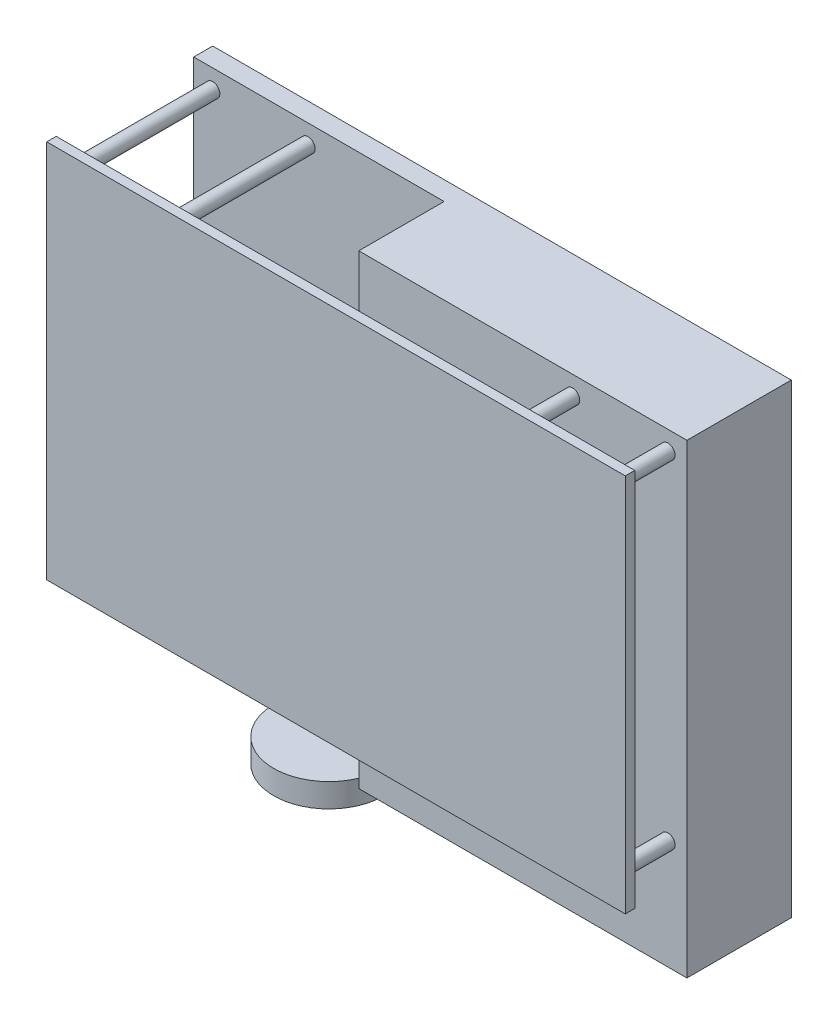
ISO-10303-21;
HEADER;
FILE_DESCRIPTION(('STEP AP214'),'2;1');
FILE_NAME('part.step','',(''),(''),'','','');
FILE_SCHEMA(('AUTOMOTIVE_DESIGN { 1 0 10303 214 1 1 1 1 }'));
ENDSEC;
DATA;
#1=APPLICATION_CONTEXT('core data for automotive mechanical design processes');
#2=APPLICATION_PROTOCOL_DEFINITION('international standard','automotive_design',2000,#1);
#3=PRODUCT_CONTEXT('',#1,'mechanical');
#4=PRODUCT('Part','Part','',(#3));
#5=PRODUCT_RELATED_PRODUCT_CATEGORY('part','',(#4));
#6=PRODUCT_DEFINITION_FORMATION('','',#4);
#7=PRODUCT_DEFINITION_CONTEXT('part definition',#1,'design');
#8=PRODUCT_DEFINITION('design','',#6,#7);
#9=PRODUCT_DEFINITION_SHAPE('','',#8);
#10=(LENGTH_UNIT() NAMED_UNIT(*) SI_UNIT(.MILLI.,.METRE.));
#11=(NAMED_UNIT(*) PLANE_ANGLE_UNIT() SI_UNIT($,.RADIAN.));
#12=(NAMED_UNIT(*) SI_UNIT($,.STERADIAN.) SOLID_ANGLE_UNIT());
#13=UNCERTAINTY_MEASURE_WITH_UNIT(LENGTH_MEASURE(1.E-05),#10,'distance_accuracy_value','');
#14=(GEOMETRIC_REPRESENTATION_CONTEXT(3) GLOBAL_UNCERTAINTY_ASSIGNED_CONTEXT((#13)) GLOBAL_UNIT_ASSIGNED_CONTEXT((#10,
#11,#12)) REPRESENTATION_CONTEXT('',''));
#15=CARTESIAN_POINT('',(0.,0.,0.));
#16=DIRECTION('',(0.,0.,1.));
#17=DIRECTION('',(1.,0.,0.));
#18=AXIS2_PLACEMENT_3D('',#15,#16,#17);
#19=CARTESIAN_POINT('',(-20.85,-63.2,-17.35));
#20=DIRECTION('',(0.,1.,0.));
#21=DIRECTION('',(0.,0.,1.));
#22=AXIS2_PLACEMENT_3D('',#19,#20,#21);
#23=CYLINDRICAL_SURFACE('',#22,11.65);
#24=CARTESIAN_POINT('',(-20.85,-63.2,-17.35));
#25=DIRECTION('',(0.,-1.,0.));
#26=DIRECTION('',(0.,0.,-1.));
#27=AXIS2_PLACEMENT_3D('',#24,#25,#26);
#28=CIRCLE('',#27,11.65);
#29=CARTESIAN_POINT('',(-20.85,-63.2,-29.));
#30=VERTEX_POINT('',#29);
#31=EDGE_CURVE('E11',#30,#30,#28,.T.);
#32=ORIENTED_EDGE('',*,*,#31,.F.);
#33=EDGE_LOOP('',(#32));
#34=FACE_BOUND('',#33,.T.);
#35=CARTESIAN_POINT('',(-20.85,-58.2,-17.35));
#36=DIRECTION('',(0.,-1.,0.));
#37=DIRECTION('',(0.,0.,-1.));
#38=AXIS2_PLACEMENT_3D('',#35,#36,#37);
#39=CIRCLE('',#38,11.65);
#40=CARTESIAN_POINT('',(-20.85,-58.2,-29.));
#41=VERTEX_POINT('',#40);
#42=EDGE_CURVE('E46',#41,#41,#39,.T.);
#43=ORIENTED_EDGE('',*,*,#42,.T.);
#44=EDGE_LOOP('',(#43));
#45=FACE_BOUND('',#44,.T.);
#46=ADVANCED_FACE('F43',(#34,#45),#23,.T.);
#47=CARTESIAN_POINT('',(-20.85,-63.2,-17.35));
#48=DIRECTION('',(0.,-1.,0.));
#49=DIRECTION('',(0.,0.,-1.));
#50=AXIS2_PLACEMENT_3D('',#47,#48,#49);
#51=PLANE('',#50);
#52=ORIENTED_EDGE('',*,*,#31,.T.);
#53=EDGE_LOOP('',(#52));
#54=FACE_BOUND('',#53,.T.);
#55=ADVANCED_FACE('F58',(#54),#51,.T.);
#56=CARTESIAN_POINT('',(-20.85,-58.2,-17.35));
#57=DIRECTION('',(0.,-1.,0.));
#58=DIRECTION('',(0.,0.,-1.));
#59=AXIS2_PLACEMENT_3D('',#56,#57,#58);
#60=PLANE('',#59);
#61=ORIENTED_EDGE('',*,*,#42,.F.);
#62=EDGE_LOOP('',(#61));
#63=FACE_BOUND('',#62,.T.);
#64=ADVANCED_FACE('F56',(#63),#60,.F.);
#65=CLOSED_SHELL('',(#46,#55,#64));
#66=MANIFOLD_SOLID_BREP('B2',#65);
#67=CARTESIAN_POINT('',(57.,-35.2,-29.));
#68=DIRECTION('',(0.,0.,1.));
#69=DIRECTION('',(1.,0.,0.));
#70=AXIS2_PLACEMENT_3D('',#67,#68,#69);
#71=CYLINDRICAL_SURFACE('',#70,1.5);
#72=CARTESIAN_POINT('',(57.,-35.2,0.));
#73=DIRECTION('',(0.,0.,1.));
#74=DIRECTION('',(1.,0.,0.));
#75=AXIS2_PLACEMENT_3D('',#72,#73,#74);
#76=CIRCLE('',#75,1.5);
#77=CARTESIAN_POINT('',(58.5,-35.2,0.));
#78=VERTEX_POINT('',#77);
#79=EDGE_CURVE('E263',#78,#78,#76,.T.);
#80=ORIENTED_EDGE('',*,*,#79,.F.);
#81=EDGE_LOOP('',(#80));
#82=FACE_BOUND('',#81,.T.);
#83=CARTESIAN_POINT('',(57.,-35.2,-11.));
#84=DIRECTION('',(0.,0.,-1.));
#85=DIRECTION('',(-1.,0.,0.));
#86=AXIS2_PLACEMENT_3D('',#83,#84,#85);
#87=CIRCLE('',#86,1.5);
#88=CARTESIAN_POINT('',(55.5,-35.2,-11.));
#89=VERTEX_POINT('',#88);
#90=EDGE_CURVE('E205',#89,#89,#87,.F.);
#91=ORIENTED_EDGE('',*,*,#90,.T.);
#92=EDGE_LOOP('',(#91));
#93=FACE_BOUND('',#92,.T.);
#94=ADVANCED_FACE('F84',(#82,#93),#71,.T.);
#95=CARTESIAN_POINT('',(57.,36.,-29.));
#96=DIRECTION('',(0.,0.,1.));
#97=DIRECTION('',(1.,0.,0.));
#98=AXIS2_PLACEMENT_3D('',#95,#96,#97);
#99=CYLINDRICAL_SURFACE('',#98,1.5);
#100=CARTESIAN_POINT('',(57.,36.,0.));
#101=DIRECTION('',(0.,0.,1.));
#102=DIRECTION('',(1.,0.,0.));
#103=AXIS2_PLACEMENT_3D('',#100,#101,#102);
#104=CIRCLE('',#103,1.5);
#105=CARTESIAN_POINT('',(58.5,36.,0.));
#106=VERTEX_POINT('',#105);
#107=EDGE_CURVE('E284',#106,#106,#104,.T.);
#108=ORIENTED_EDGE('',*,*,#107,.F.);
#109=EDGE_LOOP('',(#108));
#110=FACE_BOUND('',#109,.T.);
#111=CARTESIAN_POINT('',(57.,36.,-11.));
#112=DIRECTION('',(0.,0.,-1.));
#113=DIRECTION('',(-1.,0.,0.));
#114=AXIS2_PLACEMENT_3D('',#111,#112,#113);
#115=CIRCLE('',#114,1.5);
#116=CARTESIAN_POINT('',(55.5,36.,-11.));
#117=VERTEX_POINT('',#116);
#118=EDGE_CURVE('E201',#117,#117,#115,.F.);
#119=ORIENTED_EDGE('',*,*,#118,.T.);
#120=EDGE_LOOP('',(#119));
#121=FACE_BOUND('',#120,.T.);
#122=ADVANCED_FACE('F299',(#110,#121),#99,.T.);
#123=CARTESIAN_POINT('',(0.,0.,-29.));
#124=DIRECTION('',(0.,0.,-1.));
#125=DIRECTION('',(-1.,0.,0.));
#126=AXIS2_PLACEMENT_3D('',#123,#124,#125);
#127=PLANE('',#126);
#128=CARTESIAN_POINT('',(-36.9,36.,-29.));
#129=DIRECTION('',(0.,0.,-1.));
#130=DIRECTION('',(-1.,0.,0.));
#131=AXIS2_PLACEMENT_3D('',#128,#129,#130);
#132=CIRCLE('',#131,1.5);
#133=CARTESIAN_POINT('',(-38.4,36.,-29.));
#134=VERTEX_POINT('',#133);
#135=EDGE_CURVE('E241',#134,#134,#132,.F.);
#136=ORIENTED_EDGE('',*,*,#135,.F.);
#137=EDGE_LOOP('',(#136));
#138=FACE_BOUND('',#137,.T.);
#139=CARTESIAN_POINT('',(-11.5,-35.2,-29.));
#140=DIRECTION('',(0.,0.,-1.));
#141=DIRECTION('',(-1.,0.,0.));
#142=AXIS2_PLACEMENT_3D('',#139,#140,#141);
#143=CIRCLE('',#142,1.5);
#144=CARTESIAN_POINT('',(-13.,-35.2,-29.));
#145=VERTEX_POINT('',#144);
#146=EDGE_CURVE('E244',#145,#145,#143,.F.);
#147=ORIENTED_EDGE('',*,*,#146,.F.);
#148=EDGE_LOOP('',(#147));
#149=FACE_BOUND('',#148,.T.);
#150=CARTESIAN_POINT('',(-57.,-35.2,-29.));
#151=DIRECTION('',(0.,0.,-1.));
#152=DIRECTION('',(-1.,0.,0.));
#153=AXIS2_PLACEMENT_3D('',#150,#151,#152);
#154=CIRCLE('',#153,1.5);
#155=CARTESIAN_POINT('',(-58.5,-35.2,-29.));
#156=VERTEX_POINT('',#155);
#157=EDGE_CURVE('E221',#156,#156,#154,.F.);
#158=ORIENTED_EDGE('',*,*,#157,.F.);
#159=EDGE_LOOP('',(#158));
#160=FACE_BOUND('',#159,.T.);
#161=CARTESIAN_POINT('',(-57.,36.,-29.));
#162=DIRECTION('',(0.,0.,-1.));
#163=DIRECTION('',(-1.,0.,0.));
#164=AXIS2_PLACEMENT_3D('',#161,#162,#163);
#165=CIRCLE('',#164,1.5);
#166=CARTESIAN_POINT('',(-58.5,36.,-29.));
#167=VERTEX_POINT('',#166);
#168=EDGE_CURVE('E214',#167,#167,#165,.F.);
#169=ORIENTED_EDGE('',*,*,#168,.F.);
#170=EDGE_LOOP('',(#169));
#171=FACE_BOUND('',#170,.T.);
#172=DIRECTION('',(0.,-1.,0.));
#173=VECTOR('',#172,1.);
#174=CARTESIAN_POINT('',(-8.20000000000002,40.,-29.));
#175=LINE('',#174,#173);
#176=CARTESIAN_POINT('',(-8.20000000000002,40.,-29.));
#177=VERTEX_POINT('',#176);
#178=CARTESIAN_POINT('',(-8.19999999999998,-58.2,-29.));
#179=VERTEX_POINT('',#178);
#180=EDGE_CURVE('E194',#177,#179,#175,.T.);
#181=ORIENTED_EDGE('',*,*,#180,.F.);
#182=DIRECTION('',(1.,0.,0.));
#183=VECTOR('',#182,1.);
#184=CARTESIAN_POINT('',(61.,40.,-29.));
#185=LINE('',#184,#183);
#186=CARTESIAN_POINT('',(-61.,40.,-29.));
#187=VERTEX_POINT('',#186);
#188=EDGE_CURVE('E224',#187,#177,#185,.T.);
#189=ORIENTED_EDGE('',*,*,#188,.F.);
#190=DIRECTION('',(0.,1.,0.));
#191=VECTOR('',#190,1.);
#192=CARTESIAN_POINT('',(-61.,40.,-29.));
#193=LINE('',#192,#191);
#194=CARTESIAN_POINT('',(-61.,-58.2,-29.));
#195=VERTEX_POINT('',#194);
#196=EDGE_CURVE('E231',#195,#187,#193,.T.);
#197=ORIENTED_EDGE('',*,*,#196,.F.);
#198=DIRECTION('',(-1.,0.,0.));
#199=VECTOR('',#198,1.);
#200=CARTESIAN_POINT('',(61.,-58.2,-29.));
#201=LINE('',#200,#199);
#202=CARTESIAN_POINT('',(-20.85,-58.2,-29.));
#203=VERTEX_POINT('',#202);
#204=EDGE_CURVE('E100',#203,#195,#201,.T.);
#205=ORIENTED_EDGE('',*,*,#204,.F.);
#206=EDGE_CURVE('E229',#179,#203,#201,.T.);
#207=ORIENTED_EDGE('',*,*,#206,.F.);
#208=EDGE_LOOP('',(#181,#189,#197,#205,#207));
#209=FACE_BOUND('',#208,.T.);
#210=ADVANCED_FACE('F296',(#138,#149,#160,#171,#209),#127,.F.);
#211=CARTESIAN_POINT('',(11.5,-35.2,-29.));
#212=DIRECTION('',(0.,0.,1.));
#213=DIRECTION('',(1.,0.,0.));
#214=AXIS2_PLACEMENT_3D('',#211,#212,#213);
#215=CYLINDRICAL_SURFACE('',#214,1.5);
#216=CARTESIAN_POINT('',(11.5,-35.2,0.));
#217=DIRECTION('',(0.,0.,1.));
#218=DIRECTION('',(1.,0.,0.));
#219=AXIS2_PLACEMENT_3D('',#216,#217,#218);
#220=CIRCLE('',#219,1.5);
#221=CARTESIAN_POINT('',(13.,-35.2,0.));
#222=VERTEX_POINT('',#221);
#223=EDGE_CURVE('E215',#222,#222,#220,.F.);
#224=ORIENTED_EDGE('',*,*,#223,.T.);
#225=EDGE_LOOP('',(#224));
#226=FACE_BOUND('',#225,.T.);
#227=CARTESIAN_POINT('',(11.5,-35.2,-11.));
#228=DIRECTION('',(0.,0.,-1.));
#229=DIRECTION('',(-1.,0.,0.));
#230=AXIS2_PLACEMENT_3D('',#227,#228,#229);
#231=CIRCLE('',#230,1.5);
#232=CARTESIAN_POINT('',(10.,-35.2,-11.));
#233=VERTEX_POINT('',#232);
#234=EDGE_CURVE('E41',#233,#233,#231,.T.);
#235=ORIENTED_EDGE('',*,*,#234,.F.);
#236=EDGE_LOOP('',(#235));
#237=FACE_BOUND('',#236,.T.);
#238=ADVANCED_FACE('F298',(#226,#237),#215,.T.);
#239=CARTESIAN_POINT('',(36.9,36.,-29.));
#240=DIRECTION('',(0.,0.,1.));
#241=DIRECTION('',(1.,0.,0.));
#242=AXIS2_PLACEMENT_3D('',#239,#240,#241);
#243=CYLINDRICAL_SURFACE('',#242,1.5);
#244=CARTESIAN_POINT('',(36.9,36.,0.));
#245=DIRECTION('',(0.,0.,1.));
#246=DIRECTION('',(1.,0.,0.));
#247=AXIS2_PLACEMENT_3D('',#244,#245,#246);
#248=CIRCLE('',#247,1.5);
#249=CARTESIAN_POINT('',(38.4,36.,0.));
#250=VERTEX_POINT('',#249);
#251=EDGE_CURVE('E208',#250,#250,#248,.F.);
#252=ORIENTED_EDGE('',*,*,#251,.T.);
#253=EDGE_LOOP('',(#252));
#254=FACE_BOUND('',#253,.T.);
#255=CARTESIAN_POINT('',(36.9,36.,-11.));
#256=DIRECTION('',(0.,0.,-1.));
#257=DIRECTION('',(-1.,0.,0.));
#258=AXIS2_PLACEMENT_3D('',#255,#256,#257);
#259=CIRCLE('',#258,1.5);
#260=CARTESIAN_POINT('',(35.4,36.,-11.));
#261=VERTEX_POINT('',#260);
#262=EDGE_CURVE('E88',#261,#261,#259,.T.);
#263=ORIENTED_EDGE('',*,*,#262,.F.);
#264=EDGE_LOOP('',(#263));
#265=FACE_BOUND('',#264,.T.);
#266=ADVANCED_FACE('F357',(#254,#265),#243,.T.);
#267=CARTESIAN_POINT('',(61.,40.,2.));
#268=DIRECTION('',(-1.,0.,0.));
#269=DIRECTION('',(0.,-1.,0.));
#270=AXIS2_PLACEMENT_3D('',#267,#268,#269);
#271=PLANE('',#270);
#272=DIRECTION('',(0.,1.,0.));
#273=VECTOR('',#272,1.);
#274=CARTESIAN_POINT('',(61.,40.,0.));
#275=LINE('',#274,#273);
#276=CARTESIAN_POINT('',(61.,-40.,0.));
#277=VERTEX_POINT('',#276);
#278=CARTESIAN_POINT('',(61.,40.,0.));
#279=VERTEX_POINT('',#278);
#280=EDGE_CURVE('E259',#277,#279,#275,.T.);
#281=ORIENTED_EDGE('',*,*,#280,.T.);
#282=DIRECTION('',(0.,0.,-1.));
#283=VECTOR('',#282,1.);
#284=CARTESIAN_POINT('',(61.,40.,2.));
#285=LINE('',#284,#283);
#286=CARTESIAN_POINT('',(61.,40.,2.));
#287=VERTEX_POINT('',#286);
#288=EDGE_CURVE('E276',#287,#279,#285,.T.);
#289=ORIENTED_EDGE('',*,*,#288,.F.);
#290=DIRECTION('',(0.,1.,0.));
#291=VECTOR('',#290,1.);
#292=CARTESIAN_POINT('',(61.,40.,2.));
#293=LINE('',#292,#291);
#294=CARTESIAN_POINT('',(61.,-40.,2.));
#295=VERTEX_POINT('',#294);
#296=EDGE_CURVE('E248',#295,#287,#293,.T.);
#297=ORIENTED_EDGE('',*,*,#296,.F.);
#298=DIRECTION('',(0.,0.,-1.));
#299=VECTOR('',#298,1.);
#300=CARTESIAN_POINT('',(61.,-40.,2.));
#301=LINE('',#300,#299);
#302=EDGE_CURVE('E258',#295,#277,#301,.T.);
#303=ORIENTED_EDGE('',*,*,#302,.T.);
#304=EDGE_LOOP('',(#281,#289,#297,#303));
#305=FACE_BOUND('',#304,.T.);
#306=ADVANCED_FACE('F86',(#305),#271,.F.);
#307=CARTESIAN_POINT('',(-61.,40.,2.));
#308=DIRECTION('',(0.,-1.,0.));
#309=DIRECTION('',(0.,0.,-1.));
#310=AXIS2_PLACEMENT_3D('',#307,#308,#309);
#311=PLANE('',#310);
#312=DIRECTION('',(-1.,0.,0.));
#313=VECTOR('',#312,1.);
#314=CARTESIAN_POINT('',(-61.,40.,0.));
#315=LINE('',#314,#313);
#316=CARTESIAN_POINT('',(-61.,40.,0.));
#317=VERTEX_POINT('',#316);
#318=EDGE_CURVE('E262',#279,#317,#315,.T.);
#319=ORIENTED_EDGE('',*,*,#318,.T.);
#320=DIRECTION('',(0.,0.,-1.));
#321=VECTOR('',#320,1.);
#322=CARTESIAN_POINT('',(-61.,40.,2.));
#323=LINE('',#322,#321);
#324=CARTESIAN_POINT('',(-61.,40.,2.));
#325=VERTEX_POINT('',#324);
#326=EDGE_CURVE('E273',#325,#317,#323,.T.);
#327=ORIENTED_EDGE('',*,*,#326,.F.);
#328=DIRECTION('',(-1.,0.,0.));
#329=VECTOR('',#328,1.);
#330=CARTESIAN_POINT('',(-61.,40.,2.));
#331=LINE('',#330,#329);
#332=EDGE_CURVE('E251',#287,#325,#331,.T.);
#333=ORIENTED_EDGE('',*,*,#332,.F.);
#334=ORIENTED_EDGE('',*,*,#288,.T.);
#335=EDGE_LOOP('',(#319,#327,#333,#334));
#336=FACE_BOUND('',#335,.T.);
#337=ADVANCED_FACE('F350',(#336),#311,.F.);
#338=CARTESIAN_POINT('',(-61.,40.,2.));
#339=DIRECTION('',(1.,0.,0.));
#340=DIRECTION('',(0.,0.,-1.));
#341=AXIS2_PLACEMENT_3D('',#338,#339,#340);
#342=PLANE('',#341);
#343=DIRECTION('',(0.,-1.,0.));
#344=VECTOR('',#343,1.);
#345=CARTESIAN_POINT('',(-61.,40.,0.));
#346=LINE('',#345,#344);
#347=CARTESIAN_POINT('',(-61.,-40.,0.));
#348=VERTEX_POINT('',#347);
#349=EDGE_CURVE('E265',#317,#348,#346,.T.);
#350=ORIENTED_EDGE('',*,*,#349,.T.);
#351=DIRECTION('',(0.,0.,-1.));
#352=VECTOR('',#351,1.);
#353=CARTESIAN_POINT('',(-61.,-40.,2.));
#354=LINE('',#353,#352);
#355=CARTESIAN_POINT('',(-61.,-40.,2.));
#356=VERTEX_POINT('',#355);
#357=EDGE_CURVE('E270',#356,#348,#354,.T.);
#358=ORIENTED_EDGE('',*,*,#357,.F.);
#359=DIRECTION('',(0.,-1.,0.));
#360=VECTOR('',#359,1.);
#361=CARTESIAN_POINT('',(-61.,40.,2.));
#362=LINE('',#361,#360);
#363=EDGE_CURVE('E254',#325,#356,#362,.T.);
#364=ORIENTED_EDGE('',*,*,#363,.F.);
#365=ORIENTED_EDGE('',*,*,#326,.T.);
#366=EDGE_LOOP('',(#350,#358,#364,#365));
#367=FACE_BOUND('',#366,.T.);
#368=ADVANCED_FACE('F347',(#367),#342,.F.);
#369=CARTESIAN_POINT('',(-61.,-40.,2.));
#370=DIRECTION('',(0.,1.,0.));
#371=DIRECTION('',(0.,0.,1.));
#372=AXIS2_PLACEMENT_3D('',#369,#370,#371);
#373=PLANE('',#372);
#374=DIRECTION('',(1.,0.,0.));
#375=VECTOR('',#374,1.);
#376=CARTESIAN_POINT('',(-61.,-40.,0.));
#377=LINE('',#376,#375);
#378=EDGE_CURVE('E252',#348,#277,#377,.T.);
#379=ORIENTED_EDGE('',*,*,#378,.T.);
#380=ORIENTED_EDGE('',*,*,#302,.F.);
#381=DIRECTION('',(1.,0.,0.));
#382=VECTOR('',#381,1.);
#383=CARTESIAN_POINT('',(-61.,-40.,2.));
#384=LINE('',#383,#382);
#385=EDGE_CURVE('E256',#356,#295,#384,.T.);
#386=ORIENTED_EDGE('',*,*,#385,.F.);
#387=ORIENTED_EDGE('',*,*,#357,.T.);
#388=EDGE_LOOP('',(#379,#380,#386,#387));
#389=FACE_BOUND('',#388,.T.);
#390=ADVANCED_FACE('F340',(#389),#373,.F.);
#391=CARTESIAN_POINT('',(0.,0.,2.));
#392=DIRECTION('',(0.,0.,1.));
#393=DIRECTION('',(1.,0.,0.));
#394=AXIS2_PLACEMENT_3D('',#391,#392,#393);
#395=PLANE('',#394);
#396=ORIENTED_EDGE('',*,*,#296,.T.);
#397=ORIENTED_EDGE('',*,*,#332,.T.);
#398=ORIENTED_EDGE('',*,*,#363,.T.);
#399=ORIENTED_EDGE('',*,*,#385,.T.);
#400=EDGE_LOOP('',(#396,#397,#398,#399));
#401=FACE_BOUND('',#400,.T.);
#402=ADVANCED_FACE('F336',(#401),#395,.T.);
#403=CARTESIAN_POINT('',(0.,0.,0.));
#404=DIRECTION('',(0.,0.,1.));
#405=DIRECTION('',(1.,0.,0.));
#406=AXIS2_PLACEMENT_3D('',#403,#404,#405);
#407=PLANE('',#406);
#408=ORIENTED_EDGE('',*,*,#251,.F.);
#409=EDGE_LOOP('',(#408));
#410=FACE_BOUND('',#409,.T.);
#411=CARTESIAN_POINT('',(-57.,36.,0.));
#412=DIRECTION('',(0.,0.,1.));
#413=DIRECTION('',(1.,0.,0.));
#414=AXIS2_PLACEMENT_3D('',#411,#412,#413);
#415=CIRCLE('',#414,1.5);
#416=CARTESIAN_POINT('',(-55.5,36.,0.));
#417=VERTEX_POINT('',#416);
#418=EDGE_CURVE('E211',#417,#417,#415,.F.);
#419=ORIENTED_EDGE('',*,*,#418,.F.);
#420=EDGE_LOOP('',(#419));
#421=FACE_BOUND('',#420,.T.);
#422=ORIENTED_EDGE('',*,*,#223,.F.);
#423=EDGE_LOOP('',(#422));
#424=FACE_BOUND('',#423,.T.);
#425=CARTESIAN_POINT('',(-57.,-35.2,0.));
#426=DIRECTION('',(0.,0.,1.));
#427=DIRECTION('',(1.,0.,0.));
#428=AXIS2_PLACEMENT_3D('',#425,#426,#427);
#429=CIRCLE('',#428,1.5);
#430=CARTESIAN_POINT('',(-55.5,-35.2,0.));
#431=VERTEX_POINT('',#430);
#432=EDGE_CURVE('E218',#431,#431,#429,.F.);
#433=ORIENTED_EDGE('',*,*,#432,.F.);
#434=EDGE_LOOP('',(#433));
#435=FACE_BOUND('',#434,.T.);
#436=CARTESIAN_POINT('',(-36.9,36.,0.));
#437=DIRECTION('',(0.,0.,1.));
#438=DIRECTION('',(1.,0.,0.));
#439=AXIS2_PLACEMENT_3D('',#436,#437,#438);
#440=CIRCLE('',#439,1.5);
#441=CARTESIAN_POINT('',(-35.4,36.,0.));
#442=VERTEX_POINT('',#441);
#443=EDGE_CURVE('E247',#442,#442,#440,.T.);
#444=ORIENTED_EDGE('',*,*,#443,.T.);
#445=EDGE_LOOP('',(#444));
#446=FACE_BOUND('',#445,.T.);
#447=ORIENTED_EDGE('',*,*,#107,.T.);
#448=EDGE_LOOP('',(#447));
#449=FACE_BOUND('',#448,.T.);
#450=CARTESIAN_POINT('',(-11.5,-35.2,0.));
#451=DIRECTION('',(0.,0.,1.));
#452=DIRECTION('',(1.,0.,0.));
#453=AXIS2_PLACEMENT_3D('',#450,#451,#452);
#454=CIRCLE('',#453,1.5);
#455=CARTESIAN_POINT('',(-10.,-35.2,0.));
#456=VERTEX_POINT('',#455);
#457=EDGE_CURVE('E281',#456,#456,#454,.T.);
#458=ORIENTED_EDGE('',*,*,#457,.T.);
#459=EDGE_LOOP('',(#458));
#460=FACE_BOUND('',#459,.T.);
#461=ORIENTED_EDGE('',*,*,#79,.T.);
#462=EDGE_LOOP('',(#461));
#463=FACE_BOUND('',#462,.T.);
#464=ORIENTED_EDGE('',*,*,#280,.F.);
#465=ORIENTED_EDGE('',*,*,#378,.F.);
#466=ORIENTED_EDGE('',*,*,#349,.F.);
#467=ORIENTED_EDGE('',*,*,#318,.F.);
#468=EDGE_LOOP('',(#464,#465,#466,#467));
#469=FACE_BOUND('',#468,.T.);
#470=ADVANCED_FACE('F339',(#410,#421,#424,#435,#446,#449,#460,#463,#469),#407,.F.);
#471=CARTESIAN_POINT('',(-11.5,-35.2,-29.));
#472=DIRECTION('',(0.,0.,1.));
#473=DIRECTION('',(1.,0.,0.));
#474=AXIS2_PLACEMENT_3D('',#471,#472,#473);
#475=CYLINDRICAL_SURFACE('',#474,1.5);
#476=ORIENTED_EDGE('',*,*,#146,.T.);
#477=EDGE_LOOP('',(#476));
#478=FACE_BOUND('',#477,.T.);
#479=ORIENTED_EDGE('',*,*,#457,.F.);
#480=EDGE_LOOP('',(#479));
#481=FACE_BOUND('',#480,.T.);
#482=ADVANCED_FACE('F335',(#478,#481),#475,.T.);
#483=CARTESIAN_POINT('',(-36.9,36.,-29.));
#484=DIRECTION('',(0.,0.,1.));
#485=DIRECTION('',(1.,0.,0.));
#486=AXIS2_PLACEMENT_3D('',#483,#484,#485);
#487=CYLINDRICAL_SURFACE('',#486,1.5);
#488=ORIENTED_EDGE('',*,*,#135,.T.);
#489=EDGE_LOOP('',(#488));
#490=FACE_BOUND('',#489,.T.);
#491=ORIENTED_EDGE('',*,*,#443,.F.);
#492=EDGE_LOOP('',(#491));
#493=FACE_BOUND('',#492,.T.);
#494=ADVANCED_FACE('F421',(#490,#493),#487,.T.);
#495=CARTESIAN_POINT('',(61.,40.,-33.));
#496=DIRECTION('',(-1.,0.,0.));
#497=DIRECTION('',(0.,-1.,0.));
#498=AXIS2_PLACEMENT_3D('',#495,#496,#497);
#499=PLANE('',#498);
#500=DIRECTION('',(0.,0.,1.));
#501=VECTOR('',#500,1.);
#502=CARTESIAN_POINT('',(61.,40.,-33.));
#503=LINE('',#502,#501);
#504=CARTESIAN_POINT('',(61.,40.,-33.));
#505=VERTEX_POINT('',#504);
#506=CARTESIAN_POINT('',(61.,40.,-11.));
#507=VERTEX_POINT('',#506);
#508=EDGE_CURVE('E168',#505,#507,#503,.T.);
#509=ORIENTED_EDGE('',*,*,#508,.T.);
#510=DIRECTION('',(0.,1.,0.));
#511=VECTOR('',#510,1.);
#512=CARTESIAN_POINT('',(61.,40.,-11.));
#513=LINE('',#512,#511);
#514=CARTESIAN_POINT('',(61.,-58.2,-11.));
#515=VERTEX_POINT('',#514);
#516=EDGE_CURVE('E173',#515,#507,#513,.T.);
#517=ORIENTED_EDGE('',*,*,#516,.F.);
#518=DIRECTION('',(0.,0.,1.));
#519=VECTOR('',#518,1.);
#520=CARTESIAN_POINT('',(61.,-58.2,-33.));
#521=LINE('',#520,#519);
#522=CARTESIAN_POINT('',(61.,-58.2,-33.));
#523=VERTEX_POINT('',#522);
#524=EDGE_CURVE('E239',#523,#515,#521,.T.);
#525=ORIENTED_EDGE('',*,*,#524,.F.);
#526=DIRECTION('',(0.,-1.,0.));
#527=VECTOR('',#526,1.);
#528=CARTESIAN_POINT('',(61.,40.,-33.));
#529=LINE('',#528,#527);
#530=EDGE_CURVE('E175',#505,#523,#529,.T.);
#531=ORIENTED_EDGE('',*,*,#530,.F.);
#532=EDGE_LOOP('',(#509,#517,#525,#531));
#533=FACE_BOUND('',#532,.T.);
#534=ADVANCED_FACE('F170',(#533),#499,.F.);
#535=CARTESIAN_POINT('',(61.,-58.2,-33.));
#536=DIRECTION('',(0.,1.,0.));
#537=DIRECTION('',(0.,0.,1.));
#538=AXIS2_PLACEMENT_3D('',#535,#536,#537);
#539=PLANE('',#538);
#540=ORIENTED_EDGE('',*,*,#524,.T.);
#541=DIRECTION('',(1.,0.,0.));
#542=VECTOR('',#541,1.);
#543=CARTESIAN_POINT('',(61.,-58.2,-11.));
#544=LINE('',#543,#542);
#545=CARTESIAN_POINT('',(-8.20000000000001,-58.2,-11.));
#546=VERTEX_POINT('',#545);
#547=EDGE_CURVE('E193',#546,#515,#544,.T.);
#548=ORIENTED_EDGE('',*,*,#547,.F.);
#549=DIRECTION('',(0.,0.,-1.));
#550=VECTOR('',#549,1.);
#551=CARTESIAN_POINT('',(-8.20000000000001,-58.2,-11.));
#552=LINE('',#551,#550);
#553=EDGE_CURVE('E107',#546,#179,#552,.T.);
#554=ORIENTED_EDGE('',*,*,#553,.T.);
#555=ORIENTED_EDGE('',*,*,#206,.T.);
#556=ORIENTED_EDGE('',*,*,#204,.T.);
#557=DIRECTION('',(0.,0.,1.));
#558=VECTOR('',#557,1.);
#559=CARTESIAN_POINT('',(-61.,-58.2,-33.));
#560=LINE('',#559,#558);
#561=CARTESIAN_POINT('',(-61.,-58.2,-33.));
#562=VERTEX_POINT('',#561);
#563=EDGE_CURVE('E236',#562,#195,#560,.T.);
#564=ORIENTED_EDGE('',*,*,#563,.F.);
#565=DIRECTION('',(-1.,0.,0.));
#566=VECTOR('',#565,1.);
#567=CARTESIAN_POINT('',(61.,-58.2,-33.));
#568=LINE('',#567,#566);
#569=EDGE_CURVE('E223',#523,#562,#568,.T.);
#570=ORIENTED_EDGE('',*,*,#569,.F.);
#571=EDGE_LOOP('',(#540,#548,#554,#555,#556,#564,#570));
#572=FACE_BOUND('',#571,.T.);
#573=ADVANCED_FACE('F310',(#572),#539,.F.);
#574=CARTESIAN_POINT('',(-61.,40.,-33.));
#575=DIRECTION('',(1.,0.,0.));
#576=DIRECTION('',(0.,1.,0.));
#577=AXIS2_PLACEMENT_3D('',#574,#575,#576);
#578=PLANE('',#577);
#579=ORIENTED_EDGE('',*,*,#196,.T.);
#580=DIRECTION('',(0.,0.,1.));
#581=VECTOR('',#580,1.);
#582=CARTESIAN_POINT('',(-61.,40.,-33.));
#583=LINE('',#582,#581);
#584=CARTESIAN_POINT('',(-61.,40.,-33.));
#585=VERTEX_POINT('',#584);
#586=EDGE_CURVE('E178',#585,#187,#583,.T.);
#587=ORIENTED_EDGE('',*,*,#586,.F.);
#588=DIRECTION('',(0.,1.,0.));
#589=VECTOR('',#588,1.);
#590=CARTESIAN_POINT('',(-61.,40.,-33.));
#591=LINE('',#590,#589);
#592=EDGE_CURVE('E226',#562,#585,#591,.T.);
#593=ORIENTED_EDGE('',*,*,#592,.F.);
#594=ORIENTED_EDGE('',*,*,#563,.T.);
#595=EDGE_LOOP('',(#579,#587,#593,#594));
#596=FACE_BOUND('',#595,.T.);
#597=ADVANCED_FACE('F308',(#596),#578,.F.);
#598=CARTESIAN_POINT('',(61.,40.,-33.));
#599=DIRECTION('',(0.,-1.,0.));
#600=DIRECTION('',(0.,0.,-1.));
#601=AXIS2_PLACEMENT_3D('',#598,#599,#600);
#602=PLANE('',#601);
#603=ORIENTED_EDGE('',*,*,#188,.T.);
#604=DIRECTION('',(0.,0.,-1.));
#605=VECTOR('',#604,1.);
#606=CARTESIAN_POINT('',(-8.20000000000002,40.,-11.));
#607=LINE('',#606,#605);
#608=CARTESIAN_POINT('',(-8.20000000000002,40.,-11.));
#609=VERTEX_POINT('',#608);
#610=EDGE_CURVE('E185',#609,#177,#607,.T.);
#611=ORIENTED_EDGE('',*,*,#610,.F.);
#612=DIRECTION('',(-1.,0.,0.));
#613=VECTOR('',#612,1.);
#614=CARTESIAN_POINT('',(61.,40.,-11.));
#615=LINE('',#614,#613);
#616=EDGE_CURVE('E182',#507,#609,#615,.T.);
#617=ORIENTED_EDGE('',*,*,#616,.F.);
#618=ORIENTED_EDGE('',*,*,#508,.F.);
#619=DIRECTION('',(1.,0.,0.));
#620=VECTOR('',#619,1.);
#621=CARTESIAN_POINT('',(61.,40.,-33.));
#622=LINE('',#621,#620);
#623=EDGE_CURVE('E179',#585,#505,#622,.T.);
#624=ORIENTED_EDGE('',*,*,#623,.F.);
#625=ORIENTED_EDGE('',*,*,#586,.T.);
#626=EDGE_LOOP('',(#603,#611,#617,#618,#624,#625));
#627=FACE_BOUND('',#626,.T.);
#628=ADVANCED_FACE('F184',(#627),#602,.F.);
#629=CARTESIAN_POINT('',(0.,0.,-33.));
#630=DIRECTION('',(0.,0.,-1.));
#631=DIRECTION('',(-1.,0.,0.));
#632=AXIS2_PLACEMENT_3D('',#629,#630,#631);
#633=PLANE('',#632);
#634=ORIENTED_EDGE('',*,*,#530,.T.);
#635=ORIENTED_EDGE('',*,*,#569,.T.);
#636=ORIENTED_EDGE('',*,*,#592,.T.);
#637=ORIENTED_EDGE('',*,*,#623,.T.);
#638=EDGE_LOOP('',(#634,#635,#636,#637));
#639=FACE_BOUND('',#638,.T.);
#640=ADVANCED_FACE('F312',(#639),#633,.T.);
#641=CARTESIAN_POINT('',(-57.,-35.2,-29.));
#642=DIRECTION('',(0.,0.,1.));
#643=DIRECTION('',(1.,0.,0.));
#644=AXIS2_PLACEMENT_3D('',#641,#642,#643);
#645=CYLINDRICAL_SURFACE('',#644,1.5);
#646=ORIENTED_EDGE('',*,*,#157,.T.);
#647=EDGE_LOOP('',(#646));
#648=FACE_BOUND('',#647,.T.);
#649=ORIENTED_EDGE('',*,*,#432,.T.);
#650=EDGE_LOOP('',(#649));
#651=FACE_BOUND('',#650,.T.);
#652=ADVANCED_FACE('F314',(#648,#651),#645,.T.);
#653=CARTESIAN_POINT('',(-57.,36.,-29.));
#654=DIRECTION('',(0.,0.,1.));
#655=DIRECTION('',(1.,0.,0.));
#656=AXIS2_PLACEMENT_3D('',#653,#654,#655);
#657=CYLINDRICAL_SURFACE('',#656,1.5);
#658=ORIENTED_EDGE('',*,*,#168,.T.);
#659=EDGE_LOOP('',(#658));
#660=FACE_BOUND('',#659,.T.);
#661=ORIENTED_EDGE('',*,*,#418,.T.);
#662=EDGE_LOOP('',(#661));
#663=FACE_BOUND('',#662,.T.);
#664=ADVANCED_FACE('F293',(#660,#663),#657,.T.);
#665=CARTESIAN_POINT('',(0.,0.,-11.));
#666=DIRECTION('',(0.,0.,-1.));
#667=DIRECTION('',(-1.,0.,0.));
#668=AXIS2_PLACEMENT_3D('',#665,#666,#667);
#669=PLANE('',#668);
#670=ORIENTED_EDGE('',*,*,#234,.T.);
#671=EDGE_LOOP('',(#670));
#672=FACE_BOUND('',#671,.T.);
#673=ORIENTED_EDGE('',*,*,#262,.T.);
#674=EDGE_LOOP('',(#673));
#675=FACE_BOUND('',#674,.T.);
#676=ORIENTED_EDGE('',*,*,#516,.T.);
#677=ORIENTED_EDGE('',*,*,#616,.T.);
#678=DIRECTION('',(0.,-1.,0.));
#679=VECTOR('',#678,1.);
#680=CARTESIAN_POINT('',(-8.20000000000002,40.,-11.));
#681=LINE('',#680,#679);
#682=EDGE_CURVE('E188',#609,#546,#681,.T.);
#683=ORIENTED_EDGE('',*,*,#682,.T.);
#684=ORIENTED_EDGE('',*,*,#547,.T.);
#685=EDGE_LOOP('',(#676,#677,#683,#684));
#686=FACE_BOUND('',#685,.T.);
#687=ORIENTED_EDGE('',*,*,#118,.F.);
#688=EDGE_LOOP('',(#687));
#689=FACE_BOUND('',#688,.T.);
#690=ORIENTED_EDGE('',*,*,#90,.F.);
#691=EDGE_LOOP('',(#690));
#692=FACE_BOUND('',#691,.T.);
#693=ADVANCED_FACE('F191',(#672,#675,#686,#689,#692),#669,.F.);
#694=CARTESIAN_POINT('',(-8.20000000000002,40.,-11.));
#695=DIRECTION('',(1.,0.,0.));
#696=DIRECTION('',(0.,1.,0.));
#697=AXIS2_PLACEMENT_3D('',#694,#695,#696);
#698=PLANE('',#697);
#699=ORIENTED_EDGE('',*,*,#180,.T.);
#700=ORIENTED_EDGE('',*,*,#553,.F.);
#701=ORIENTED_EDGE('',*,*,#682,.F.);
#702=ORIENTED_EDGE('',*,*,#610,.T.);
#703=EDGE_LOOP('',(#699,#700,#701,#702));
#704=FACE_BOUND('',#703,.T.);
#705=ADVANCED_FACE('F383',(#704),#698,.F.);
#706=CLOSED_SHELL('',(#94,#122,#210,#238,#266,#306,#337,#368,#390,#402,#470,#482,#494,#534,#573,
#597,#628,#640,#652,#664,#693,#705));
#707=MANIFOLD_SOLID_BREP('B6',#706);
#708=ADVANCED_BREP_SHAPE_REPRESENTATION('',(#18,#66,#707),#14);
#709=SHAPE_DEFINITION_REPRESENTATION(#9,#708);
ENDSEC;
END-ISO-10303-21;
